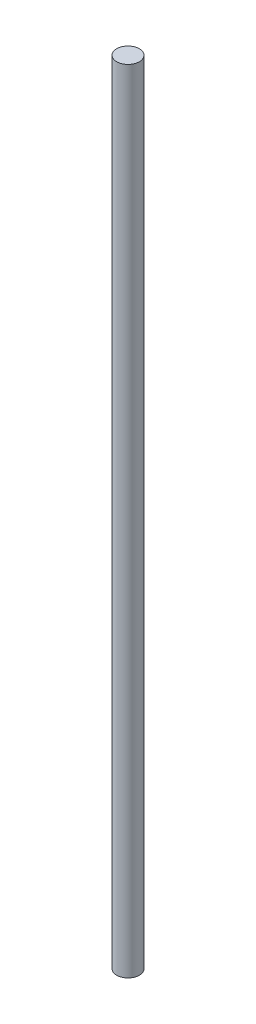
ISO-10303-21;
HEADER;
FILE_DESCRIPTION(('STEP AP214'),'2;1');
FILE_NAME('part.step','',(''),(''),'','','');
FILE_SCHEMA(('AUTOMOTIVE_DESIGN { 1 0 10303 214 1 1 1 1 }'));
ENDSEC;
DATA;
#1=APPLICATION_CONTEXT('core data for automotive mechanical design processes');
#2=APPLICATION_PROTOCOL_DEFINITION('international standard','automotive_design',2000,#1);
#3=PRODUCT_CONTEXT('',#1,'mechanical');
#4=PRODUCT('Part','Part','',(#3));
#5=PRODUCT_RELATED_PRODUCT_CATEGORY('part','',(#4));
#6=PRODUCT_DEFINITION_FORMATION('','',#4);
#7=PRODUCT_DEFINITION_CONTEXT('part definition',#1,'design');
#8=PRODUCT_DEFINITION('design','',#6,#7);
#9=PRODUCT_DEFINITION_SHAPE('','',#8);
#10=(LENGTH_UNIT() NAMED_UNIT(*) SI_UNIT(.MILLI.,.METRE.));
#11=(NAMED_UNIT(*) PLANE_ANGLE_UNIT() SI_UNIT($,.RADIAN.));
#12=(NAMED_UNIT(*) SI_UNIT($,.STERADIAN.) SOLID_ANGLE_UNIT());
#13=UNCERTAINTY_MEASURE_WITH_UNIT(LENGTH_MEASURE(1.E-05),#10,'distance_accuracy_value','');
#14=(GEOMETRIC_REPRESENTATION_CONTEXT(3) GLOBAL_UNCERTAINTY_ASSIGNED_CONTEXT((#13)) GLOBAL_UNIT_ASSIGNED_CONTEXT((#10,
#11,#12)) REPRESENTATION_CONTEXT('',''));
#15=CARTESIAN_POINT('',(0.,0.,0.));
#16=DIRECTION('',(0.,0.,1.));
#17=DIRECTION('',(1.,0.,0.));
#18=AXIS2_PLACEMENT_3D('',#15,#16,#17);
#19=CARTESIAN_POINT('',(2.5,350.,14.5));
#20=DIRECTION('',(0.,1.,0.));
#21=DIRECTION('',(0.,0.,1.));
#22=AXIS2_PLACEMENT_3D('',#19,#20,#21);
#23=PLANE('',#22);
#24=CARTESIAN_POINT('',(0.,350.,14.5));
#25=DIRECTION('',(0.,-1.,0.));
#26=DIRECTION('',(0.,0.,-1.));
#27=AXIS2_PLACEMENT_3D('',#24,#25,#26);
#28=CIRCLE('',#27,5.);
#29=CARTESIAN_POINT('',(0.,350.,9.5));
#30=VERTEX_POINT('',#29);
#31=EDGE_CURVE('E18',#30,#30,#28,.T.);
#32=ORIENTED_EDGE('',*,*,#31,.F.);
#33=EDGE_LOOP('',(#32));
#34=FACE_BOUND('',#33,.T.);
#35=ADVANCED_FACE('F15',(#34),#23,.T.);
#36=CARTESIAN_POINT('',(2.5,0.,14.5));
#37=DIRECTION('',(0.,-1.,0.));
#38=DIRECTION('',(0.,0.,-1.));
#39=AXIS2_PLACEMENT_3D('',#36,#37,#38);
#40=PLANE('',#39);
#41=CARTESIAN_POINT('',(0.,0.,14.5));
#42=DIRECTION('',(0.,-1.,0.));
#43=DIRECTION('',(0.,0.,-1.));
#44=AXIS2_PLACEMENT_3D('',#41,#42,#43);
#45=CIRCLE('',#44,5.);
#46=CARTESIAN_POINT('',(0.,0.,9.5));
#47=VERTEX_POINT('',#46);
#48=EDGE_CURVE('E10',#47,#47,#45,.F.);
#49=ORIENTED_EDGE('',*,*,#48,.F.);
#50=EDGE_LOOP('',(#49));
#51=FACE_BOUND('',#50,.T.);
#52=ADVANCED_FACE('F30',(#51),#40,.T.);
#53=CARTESIAN_POINT('',(0.,166.5,14.5));
#54=DIRECTION('',(0.,-1.,0.));
#55=DIRECTION('',(0.,0.,-1.));
#56=AXIS2_PLACEMENT_3D('',#53,#54,#55);
#57=CYLINDRICAL_SURFACE('',#56,5.);
#58=ORIENTED_EDGE('',*,*,#31,.T.);
#59=EDGE_LOOP('',(#58));
#60=FACE_BOUND('',#59,.T.);
#61=ORIENTED_EDGE('',*,*,#48,.T.);
#62=EDGE_LOOP('',(#61));
#63=FACE_BOUND('',#62,.T.);
#64=ADVANCED_FACE('F27',(#60,#63),#57,.T.);
#65=CLOSED_SHELL('',(#35,#52,#64));
#66=MANIFOLD_SOLID_BREP('B1',#65);
#67=ADVANCED_BREP_SHAPE_REPRESENTATION('',(#18,#66),#14);
#68=SHAPE_DEFINITION_REPRESENTATION(#9,#67);
ENDSEC;
END-ISO-10303-21;
